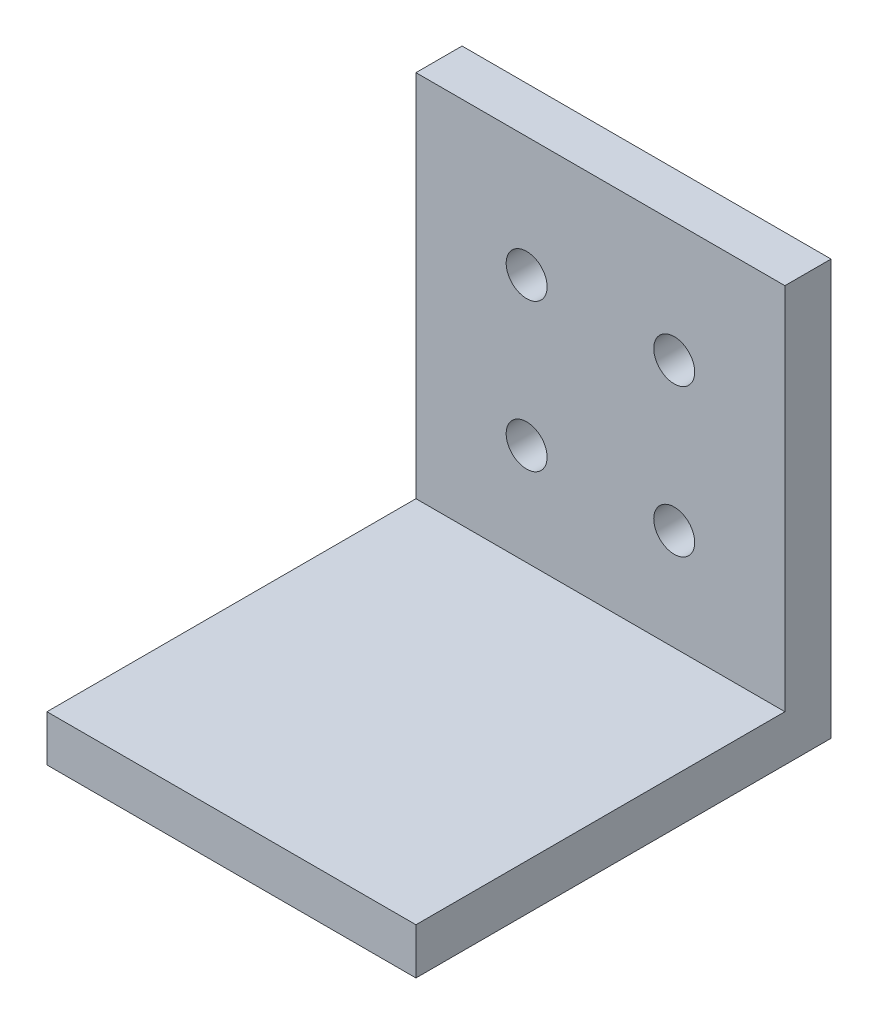
ISO-10303-21;
HEADER;
FILE_DESCRIPTION(('STEP AP214'),'2;1');
FILE_NAME('part.step','',(''),(''),'','','');
FILE_SCHEMA(('AUTOMOTIVE_DESIGN { 1 0 10303 214 1 1 1 1 }'));
ENDSEC;
DATA;
#1=APPLICATION_CONTEXT('core data for automotive mechanical design processes');
#2=APPLICATION_PROTOCOL_DEFINITION('international standard','automotive_design',2000,#1);
#3=PRODUCT_CONTEXT('',#1,'mechanical');
#4=PRODUCT('Part','Part','',(#3));
#5=PRODUCT_RELATED_PRODUCT_CATEGORY('part','',(#4));
#6=PRODUCT_DEFINITION_FORMATION('','',#4);
#7=PRODUCT_DEFINITION_CONTEXT('part definition',#1,'design');
#8=PRODUCT_DEFINITION('design','',#6,#7);
#9=PRODUCT_DEFINITION_SHAPE('','',#8);
#10=(LENGTH_UNIT() NAMED_UNIT(*) SI_UNIT(.MILLI.,.METRE.));
#11=(NAMED_UNIT(*) PLANE_ANGLE_UNIT() SI_UNIT($,.RADIAN.));
#12=(NAMED_UNIT(*) SI_UNIT($,.STERADIAN.) SOLID_ANGLE_UNIT());
#13=UNCERTAINTY_MEASURE_WITH_UNIT(LENGTH_MEASURE(1.E-05),#10,'distance_accuracy_value','');
#14=(GEOMETRIC_REPRESENTATION_CONTEXT(3) GLOBAL_UNCERTAINTY_ASSIGNED_CONTEXT((#13)) GLOBAL_UNIT_ASSIGNED_CONTEXT((#10,
#11,#12)) REPRESENTATION_CONTEXT('',''));
#15=CARTESIAN_POINT('',(0.,0.,0.));
#16=DIRECTION('',(0.,0.,1.));
#17=DIRECTION('',(1.,0.,0.));
#18=AXIS2_PLACEMENT_3D('',#15,#16,#17);
#19=CARTESIAN_POINT('',(-5.08000000000001,-4.12750000000002,28.575));
#20=DIRECTION('',(0.,0.,-1.));
#21=DIRECTION('',(-1.,0.,0.));
#22=AXIS2_PLACEMENT_3D('',#19,#20,#21);
#23=CYLINDRICAL_SURFACE('',#22,1.4097);
#24=CARTESIAN_POINT('',(-5.08000000000001,-4.12750000000002,3.175));
#25=DIRECTION('',(0.,0.,1.));
#26=DIRECTION('',(1.,0.,0.));
#27=AXIS2_PLACEMENT_3D('',#24,#25,#26);
#28=CIRCLE('',#27,1.4097);
#29=CARTESIAN_POINT('',(-3.67030000000001,-4.12750000000002,3.175));
#30=VERTEX_POINT('',#29);
#31=EDGE_CURVE('E47',#30,#30,#28,.T.);
#32=ORIENTED_EDGE('',*,*,#31,.T.);
#33=EDGE_LOOP('',(#32));
#34=FACE_BOUND('',#33,.T.);
#35=CARTESIAN_POINT('',(-5.08000000000001,-4.12750000000002,0.));
#36=DIRECTION('',(0.,0.,-1.));
#37=DIRECTION('',(-1.,0.,0.));
#38=AXIS2_PLACEMENT_3D('',#35,#36,#37);
#39=CIRCLE('',#38,1.4097);
#40=CARTESIAN_POINT('',(-6.48970000000001,-4.12750000000002,0.));
#41=VERTEX_POINT('',#40);
#42=EDGE_CURVE('E11',#41,#41,#39,.T.);
#43=ORIENTED_EDGE('',*,*,#42,.T.);
#44=EDGE_LOOP('',(#43));
#45=FACE_BOUND('',#44,.T.);
#46=ADVANCED_FACE('F39',(#34,#45),#23,.F.);
#47=CARTESIAN_POINT('',(-5.08000000000001,6.03249999999998,28.575));
#48=DIRECTION('',(0.,0.,-1.));
#49=DIRECTION('',(-1.,0.,0.));
#50=AXIS2_PLACEMENT_3D('',#47,#48,#49);
#51=CYLINDRICAL_SURFACE('',#50,1.4097);
#52=CARTESIAN_POINT('',(-5.08000000000001,6.03249999999998,3.175));
#53=DIRECTION('',(0.,0.,1.));
#54=DIRECTION('',(1.,0.,0.));
#55=AXIS2_PLACEMENT_3D('',#52,#53,#54);
#56=CIRCLE('',#55,1.4097);
#57=CARTESIAN_POINT('',(-3.67030000000001,6.03249999999998,3.175));
#58=VERTEX_POINT('',#57);
#59=EDGE_CURVE('E135',#58,#58,#56,.T.);
#60=ORIENTED_EDGE('',*,*,#59,.T.);
#61=EDGE_LOOP('',(#60));
#62=FACE_BOUND('',#61,.T.);
#63=CARTESIAN_POINT('',(-5.08000000000001,6.03249999999998,0.));
#64=DIRECTION('',(0.,0.,-1.));
#65=DIRECTION('',(-1.,0.,0.));
#66=AXIS2_PLACEMENT_3D('',#63,#64,#65);
#67=CIRCLE('',#66,1.4097);
#68=CARTESIAN_POINT('',(-6.48970000000001,6.03249999999998,0.));
#69=VERTEX_POINT('',#68);
#70=EDGE_CURVE('E139',#69,#69,#67,.T.);
#71=ORIENTED_EDGE('',*,*,#70,.T.);
#72=EDGE_LOOP('',(#71));
#73=FACE_BOUND('',#72,.T.);
#74=ADVANCED_FACE('F165',(#62,#73),#51,.F.);
#75=CARTESIAN_POINT('',(12.7,14.2875,3.175));
#76=DIRECTION('',(-1.,0.,0.));
#77=DIRECTION('',(0.,-1.,0.));
#78=AXIS2_PLACEMENT_3D('',#75,#76,#77);
#79=PLANE('',#78);
#80=DIRECTION('',(0.,1.,0.));
#81=VECTOR('',#80,1.);
#82=CARTESIAN_POINT('',(12.7,14.2875,0.));
#83=LINE('',#82,#81);
#84=CARTESIAN_POINT('',(12.7,-14.2875,0.));
#85=VERTEX_POINT('',#84);
#86=CARTESIAN_POINT('',(12.7,14.2875,0.));
#87=VERTEX_POINT('',#86);
#88=EDGE_CURVE('E101',#85,#87,#83,.T.);
#89=ORIENTED_EDGE('',*,*,#88,.T.);
#90=DIRECTION('',(0.,0.,-1.));
#91=VECTOR('',#90,1.);
#92=CARTESIAN_POINT('',(12.7,14.2875,3.175));
#93=LINE('',#92,#91);
#94=CARTESIAN_POINT('',(12.7,14.2875,3.175));
#95=VERTEX_POINT('',#94);
#96=EDGE_CURVE('E132',#95,#87,#93,.T.);
#97=ORIENTED_EDGE('',*,*,#96,.F.);
#98=DIRECTION('',(0.,1.,0.));
#99=VECTOR('',#98,1.);
#100=CARTESIAN_POINT('',(12.7,14.2875,3.175));
#101=LINE('',#100,#99);
#102=CARTESIAN_POINT('',(12.7,-11.1125,3.175));
#103=VERTEX_POINT('',#102);
#104=EDGE_CURVE('E93',#103,#95,#101,.T.);
#105=ORIENTED_EDGE('',*,*,#104,.F.);
#106=DIRECTION('',(0.,0.,-1.));
#107=VECTOR('',#106,1.);
#108=CARTESIAN_POINT('',(12.7,-11.1125,28.575));
#109=LINE('',#108,#107);
#110=CARTESIAN_POINT('',(12.7,-11.1125,28.575));
#111=VERTEX_POINT('',#110);
#112=EDGE_CURVE('E113',#111,#103,#109,.T.);
#113=ORIENTED_EDGE('',*,*,#112,.F.);
#114=DIRECTION('',(0.,1.,0.));
#115=VECTOR('',#114,1.);
#116=CARTESIAN_POINT('',(12.7,-14.2875,28.575));
#117=LINE('',#116,#115);
#118=CARTESIAN_POINT('',(12.7,-14.2875,28.575));
#119=VERTEX_POINT('',#118);
#120=EDGE_CURVE('E104',#119,#111,#117,.T.);
#121=ORIENTED_EDGE('',*,*,#120,.F.);
#122=DIRECTION('',(0.,0.,-1.));
#123=VECTOR('',#122,1.);
#124=CARTESIAN_POINT('',(12.7,-14.2875,3.175));
#125=LINE('',#124,#123);
#126=EDGE_CURVE('E85',#119,#85,#125,.T.);
#127=ORIENTED_EDGE('',*,*,#126,.T.);
#128=EDGE_LOOP('',(#89,#97,#105,#113,#121,#127));
#129=FACE_BOUND('',#128,.T.);
#130=ADVANCED_FACE('F99',(#129),#79,.F.);
#131=CARTESIAN_POINT('',(-12.7,14.2875,3.175));
#132=DIRECTION('',(0.,-1.,0.));
#133=DIRECTION('',(0.,0.,-1.));
#134=AXIS2_PLACEMENT_3D('',#131,#132,#133);
#135=PLANE('',#134);
#136=DIRECTION('',(-1.,0.,0.));
#137=VECTOR('',#136,1.);
#138=CARTESIAN_POINT('',(-12.7,14.2875,0.));
#139=LINE('',#138,#137);
#140=CARTESIAN_POINT('',(-12.7,14.2875,0.));
#141=VERTEX_POINT('',#140);
#142=EDGE_CURVE('E110',#87,#141,#139,.T.);
#143=ORIENTED_EDGE('',*,*,#142,.T.);
#144=DIRECTION('',(0.,0.,-1.));
#145=VECTOR('',#144,1.);
#146=CARTESIAN_POINT('',(-12.7,14.2875,3.175));
#147=LINE('',#146,#145);
#148=CARTESIAN_POINT('',(-12.7,14.2875,3.175));
#149=VERTEX_POINT('',#148);
#150=EDGE_CURVE('E128',#149,#141,#147,.T.);
#151=ORIENTED_EDGE('',*,*,#150,.F.);
#152=DIRECTION('',(-1.,0.,0.));
#153=VECTOR('',#152,1.);
#154=CARTESIAN_POINT('',(-12.7,14.2875,3.175));
#155=LINE('',#154,#153);
#156=EDGE_CURVE('E60',#95,#149,#155,.T.);
#157=ORIENTED_EDGE('',*,*,#156,.F.);
#158=ORIENTED_EDGE('',*,*,#96,.T.);
#159=EDGE_LOOP('',(#143,#151,#157,#158));
#160=FACE_BOUND('',#159,.T.);
#161=ADVANCED_FACE('F173',(#160),#135,.F.);
#162=CARTESIAN_POINT('',(-12.7,14.2875,3.175));
#163=DIRECTION('',(1.,0.,0.));
#164=DIRECTION('',(0.,1.,0.));
#165=AXIS2_PLACEMENT_3D('',#162,#163,#164);
#166=PLANE('',#165);
#167=DIRECTION('',(0.,-1.,0.));
#168=VECTOR('',#167,1.);
#169=CARTESIAN_POINT('',(-12.7,14.2875,0.));
#170=LINE('',#169,#168);
#171=CARTESIAN_POINT('',(-12.7,-14.2875,0.));
#172=VERTEX_POINT('',#171);
#173=EDGE_CURVE('E94',#141,#172,#170,.T.);
#174=ORIENTED_EDGE('',*,*,#173,.T.);
#175=DIRECTION('',(0.,0.,-1.));
#176=VECTOR('',#175,1.);
#177=CARTESIAN_POINT('',(-12.7,-14.2875,3.175));
#178=LINE('',#177,#176);
#179=CARTESIAN_POINT('',(-12.7,-14.2875,28.575));
#180=VERTEX_POINT('',#179);
#181=EDGE_CURVE('E88',#180,#172,#178,.T.);
#182=ORIENTED_EDGE('',*,*,#181,.F.);
#183=DIRECTION('',(0.,-1.,0.));
#184=VECTOR('',#183,1.);
#185=CARTESIAN_POINT('',(-12.7,-14.2875,28.575));
#186=LINE('',#185,#184);
#187=CARTESIAN_POINT('',(-12.7,-11.1125,28.575));
#188=VERTEX_POINT('',#187);
#189=EDGE_CURVE('E210',#188,#180,#186,.T.);
#190=ORIENTED_EDGE('',*,*,#189,.F.);
#191=DIRECTION('',(0.,0.,-1.));
#192=VECTOR('',#191,1.);
#193=CARTESIAN_POINT('',(-12.7,-11.1125,28.575));
#194=LINE('',#193,#192);
#195=CARTESIAN_POINT('',(-12.7,-11.1125,3.175));
#196=VERTEX_POINT('',#195);
#197=EDGE_CURVE('E119',#188,#196,#194,.T.);
#198=ORIENTED_EDGE('',*,*,#197,.T.);
#199=DIRECTION('',(0.,-1.,0.));
#200=VECTOR('',#199,1.);
#201=CARTESIAN_POINT('',(-12.7,14.2875,3.175));
#202=LINE('',#201,#200);
#203=EDGE_CURVE('E106',#149,#196,#202,.T.);
#204=ORIENTED_EDGE('',*,*,#203,.F.);
#205=ORIENTED_EDGE('',*,*,#150,.T.);
#206=EDGE_LOOP('',(#174,#182,#190,#198,#204,#205));
#207=FACE_BOUND('',#206,.T.);
#208=ADVANCED_FACE('F159',(#207),#166,.F.);
#209=CARTESIAN_POINT('',(-12.7,-14.2875,3.175));
#210=DIRECTION('',(0.,1.,0.));
#211=DIRECTION('',(0.,0.,1.));
#212=AXIS2_PLACEMENT_3D('',#209,#210,#211);
#213=PLANE('',#212);
#214=DIRECTION('',(1.,0.,0.));
#215=VECTOR('',#214,1.);
#216=CARTESIAN_POINT('',(-12.7,-14.2875,0.));
#217=LINE('',#216,#215);
#218=EDGE_CURVE('E80',#172,#85,#217,.T.);
#219=ORIENTED_EDGE('',*,*,#218,.T.);
#220=ORIENTED_EDGE('',*,*,#126,.F.);
#221=DIRECTION('',(1.,0.,0.));
#222=VECTOR('',#221,1.);
#223=CARTESIAN_POINT('',(-12.7,-14.2875,28.575));
#224=LINE('',#223,#222);
#225=EDGE_CURVE('E205',#180,#119,#224,.T.);
#226=ORIENTED_EDGE('',*,*,#225,.F.);
#227=ORIENTED_EDGE('',*,*,#181,.T.);
#228=EDGE_LOOP('',(#219,#220,#226,#227));
#229=FACE_BOUND('',#228,.T.);
#230=ADVANCED_FACE('F82',(#229),#213,.F.);
#231=CARTESIAN_POINT('',(0.,0.,3.175));
#232=DIRECTION('',(0.,0.,1.));
#233=DIRECTION('',(1.,0.,0.));
#234=AXIS2_PLACEMENT_3D('',#231,#232,#233);
#235=PLANE('',#234);
#236=CARTESIAN_POINT('',(5.07999999999999,-4.12750000000002,3.175));
#237=DIRECTION('',(0.,0.,1.));
#238=DIRECTION('',(1.,0.,0.));
#239=AXIS2_PLACEMENT_3D('',#236,#237,#238);
#240=CIRCLE('',#239,1.4097);
#241=CARTESIAN_POINT('',(6.48969999999999,-4.12750000000002,3.175));
#242=VERTEX_POINT('',#241);
#243=EDGE_CURVE('E250',#242,#242,#240,.T.);
#244=ORIENTED_EDGE('',*,*,#243,.F.);
#245=EDGE_LOOP('',(#244));
#246=FACE_BOUND('',#245,.T.);
#247=CARTESIAN_POINT('',(5.07999999999999,6.03249999999998,3.175));
#248=DIRECTION('',(0.,0.,1.));
#249=DIRECTION('',(1.,0.,0.));
#250=AXIS2_PLACEMENT_3D('',#247,#248,#249);
#251=CIRCLE('',#250,1.4097);
#252=CARTESIAN_POINT('',(6.48969999999999,6.03249999999998,3.175));
#253=VERTEX_POINT('',#252);
#254=EDGE_CURVE('E211',#253,#253,#251,.T.);
#255=ORIENTED_EDGE('',*,*,#254,.F.);
#256=EDGE_LOOP('',(#255));
#257=FACE_BOUND('',#256,.T.);
#258=DIRECTION('',(-1.,0.,0.));
#259=VECTOR('',#258,1.);
#260=CARTESIAN_POINT('',(-12.7,-11.1125,3.175));
#261=LINE('',#260,#259);
#262=EDGE_CURVE('E54',#103,#196,#261,.T.);
#263=ORIENTED_EDGE('',*,*,#262,.F.);
#264=ORIENTED_EDGE('',*,*,#104,.T.);
#265=ORIENTED_EDGE('',*,*,#156,.T.);
#266=ORIENTED_EDGE('',*,*,#203,.T.);
#267=EDGE_LOOP('',(#263,#264,#265,#266));
#268=FACE_BOUND('',#267,.T.);
#269=ORIENTED_EDGE('',*,*,#59,.F.);
#270=EDGE_LOOP('',(#269));
#271=FACE_BOUND('',#270,.T.);
#272=ORIENTED_EDGE('',*,*,#31,.F.);
#273=EDGE_LOOP('',(#272));
#274=FACE_BOUND('',#273,.T.);
#275=ADVANCED_FACE('F148',(#246,#257,#268,#271,#274),#235,.T.);
#276=CARTESIAN_POINT('',(0.,0.,0.));
#277=DIRECTION('',(0.,0.,1.));
#278=DIRECTION('',(1.,0.,0.));
#279=AXIS2_PLACEMENT_3D('',#276,#277,#278);
#280=PLANE('',#279);
#281=CARTESIAN_POINT('',(5.07999999999999,-4.12750000000002,0.));
#282=DIRECTION('',(0.,0.,-1.));
#283=DIRECTION('',(-1.,0.,0.));
#284=AXIS2_PLACEMENT_3D('',#281,#282,#283);
#285=CIRCLE('',#284,1.4097);
#286=CARTESIAN_POINT('',(3.67029999999999,-4.12750000000002,0.));
#287=VERTEX_POINT('',#286);
#288=EDGE_CURVE('E229',#287,#287,#285,.T.);
#289=ORIENTED_EDGE('',*,*,#288,.F.);
#290=EDGE_LOOP('',(#289));
#291=FACE_BOUND('',#290,.T.);
#292=CARTESIAN_POINT('',(5.07999999999999,6.03249999999998,0.));
#293=DIRECTION('',(0.,0.,-1.));
#294=DIRECTION('',(-1.,0.,0.));
#295=AXIS2_PLACEMENT_3D('',#292,#293,#294);
#296=CIRCLE('',#295,1.4097);
#297=CARTESIAN_POINT('',(3.67029999999999,6.03249999999998,0.));
#298=VERTEX_POINT('',#297);
#299=EDGE_CURVE('E223',#298,#298,#296,.T.);
#300=ORIENTED_EDGE('',*,*,#299,.F.);
#301=EDGE_LOOP('',(#300));
#302=FACE_BOUND('',#301,.T.);
#303=ORIENTED_EDGE('',*,*,#88,.F.);
#304=ORIENTED_EDGE('',*,*,#218,.F.);
#305=ORIENTED_EDGE('',*,*,#173,.F.);
#306=ORIENTED_EDGE('',*,*,#142,.F.);
#307=EDGE_LOOP('',(#303,#304,#305,#306));
#308=FACE_BOUND('',#307,.T.);
#309=ORIENTED_EDGE('',*,*,#70,.F.);
#310=EDGE_LOOP('',(#309));
#311=FACE_BOUND('',#310,.T.);
#312=ORIENTED_EDGE('',*,*,#42,.F.);
#313=EDGE_LOOP('',(#312));
#314=FACE_BOUND('',#313,.T.);
#315=ADVANCED_FACE('F108',(#291,#302,#308,#311,#314),#280,.F.);
#316=CARTESIAN_POINT('',(-12.7,-11.1125,28.575));
#317=DIRECTION('',(0.,-1.,0.));
#318=DIRECTION('',(0.,0.,-1.));
#319=AXIS2_PLACEMENT_3D('',#316,#317,#318);
#320=PLANE('',#319);
#321=ORIENTED_EDGE('',*,*,#262,.T.);
#322=ORIENTED_EDGE('',*,*,#197,.F.);
#323=DIRECTION('',(-1.,0.,0.));
#324=VECTOR('',#323,1.);
#325=CARTESIAN_POINT('',(-12.7,-11.1125,28.575));
#326=LINE('',#325,#324);
#327=EDGE_CURVE('E196',#111,#188,#326,.T.);
#328=ORIENTED_EDGE('',*,*,#327,.F.);
#329=ORIENTED_EDGE('',*,*,#112,.T.);
#330=EDGE_LOOP('',(#321,#322,#328,#329));
#331=FACE_BOUND('',#330,.T.);
#332=ADVANCED_FACE('F156',(#331),#320,.F.);
#333=CARTESIAN_POINT('',(0.,0.,28.575));
#334=DIRECTION('',(0.,0.,-1.));
#335=DIRECTION('',(-1.,0.,0.));
#336=AXIS2_PLACEMENT_3D('',#333,#334,#335);
#337=PLANE('',#336);
#338=ORIENTED_EDGE('',*,*,#189,.T.);
#339=ORIENTED_EDGE('',*,*,#225,.T.);
#340=ORIENTED_EDGE('',*,*,#120,.T.);
#341=ORIENTED_EDGE('',*,*,#327,.T.);
#342=EDGE_LOOP('',(#338,#339,#340,#341));
#343=FACE_BOUND('',#342,.T.);
#344=ADVANCED_FACE('F233',(#343),#337,.F.);
#345=CARTESIAN_POINT('',(5.07999999999999,6.03249999999998,28.575));
#346=DIRECTION('',(0.,0.,-1.));
#347=DIRECTION('',(-1.,0.,0.));
#348=AXIS2_PLACEMENT_3D('',#345,#346,#347);
#349=CYLINDRICAL_SURFACE('',#348,1.4097);
#350=ORIENTED_EDGE('',*,*,#254,.T.);
#351=EDGE_LOOP('',(#350));
#352=FACE_BOUND('',#351,.T.);
#353=ORIENTED_EDGE('',*,*,#299,.T.);
#354=EDGE_LOOP('',(#353));
#355=FACE_BOUND('',#354,.T.);
#356=ADVANCED_FACE('F235',(#352,#355),#349,.F.);
#357=CARTESIAN_POINT('',(5.07999999999999,-4.12750000000002,28.575));
#358=DIRECTION('',(0.,0.,-1.));
#359=DIRECTION('',(-1.,0.,0.));
#360=AXIS2_PLACEMENT_3D('',#357,#358,#359);
#361=CYLINDRICAL_SURFACE('',#360,1.4097);
#362=ORIENTED_EDGE('',*,*,#243,.T.);
#363=EDGE_LOOP('',(#362));
#364=FACE_BOUND('',#363,.T.);
#365=ORIENTED_EDGE('',*,*,#288,.T.);
#366=EDGE_LOOP('',(#365));
#367=FACE_BOUND('',#366,.T.);
#368=ADVANCED_FACE('F241',(#364,#367),#361,.F.);
#369=CLOSED_SHELL('',(#46,#74,#130,#161,#208,#230,#275,#315,#332,#344,#356,#368));
#370=MANIFOLD_SOLID_BREP('B2',#369);
#371=ADVANCED_BREP_SHAPE_REPRESENTATION('',(#18,#370),#14);
#372=SHAPE_DEFINITION_REPRESENTATION(#9,#371);
ENDSEC;
END-ISO-10303-21;
